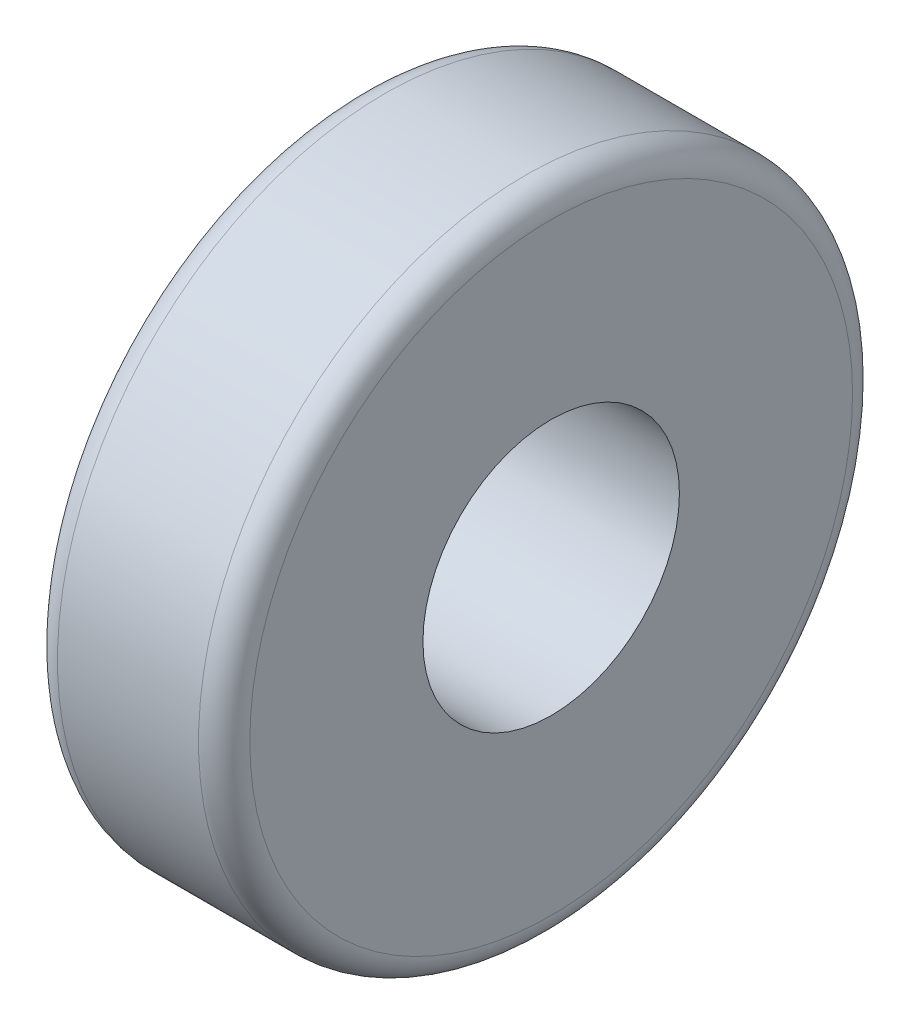
ISO-10303-21;
HEADER;
FILE_DESCRIPTION(('STEP AP214'),'2;1');
FILE_NAME('part.step','',(''),(''),'','','');
FILE_SCHEMA(('AUTOMOTIVE_DESIGN { 1 0 10303 214 1 1 1 1 }'));
ENDSEC;
DATA;
#1=APPLICATION_CONTEXT('core data for automotive mechanical design processes');
#2=APPLICATION_PROTOCOL_DEFINITION('international standard','automotive_design',2000,#1);
#3=PRODUCT_CONTEXT('',#1,'mechanical');
#4=PRODUCT('Part','Part','',(#3));
#5=PRODUCT_RELATED_PRODUCT_CATEGORY('part','',(#4));
#6=PRODUCT_DEFINITION_FORMATION('','',#4);
#7=PRODUCT_DEFINITION_CONTEXT('part definition',#1,'design');
#8=PRODUCT_DEFINITION('design','',#6,#7);
#9=PRODUCT_DEFINITION_SHAPE('','',#8);
#10=(LENGTH_UNIT() NAMED_UNIT(*) SI_UNIT(.MILLI.,.METRE.));
#11=(NAMED_UNIT(*) PLANE_ANGLE_UNIT() SI_UNIT($,.RADIAN.));
#12=(NAMED_UNIT(*) SI_UNIT($,.STERADIAN.) SOLID_ANGLE_UNIT());
#13=UNCERTAINTY_MEASURE_WITH_UNIT(LENGTH_MEASURE(1.E-05),#10,'distance_accuracy_value','');
#14=(GEOMETRIC_REPRESENTATION_CONTEXT(3) GLOBAL_UNCERTAINTY_ASSIGNED_CONTEXT((#13)) GLOBAL_UNIT_ASSIGNED_CONTEXT((#10,
#11,#12)) REPRESENTATION_CONTEXT('',''));
#15=CARTESIAN_POINT('',(0.,0.,0.));
#16=DIRECTION('',(0.,0.,1.));
#17=DIRECTION('',(1.,0.,0.));
#18=AXIS2_PLACEMENT_3D('',#15,#16,#17);
#19=CARTESIAN_POINT('',(1.5,0.,0.));
#20=DIRECTION('',(1.,0.,0.));
#21=DIRECTION('',(0.,0.,-1.));
#22=AXIS2_PLACEMENT_3D('',#19,#20,#21);
#23=PLANE('',#22);
#24=CARTESIAN_POINT('',(1.5,0.,0.));
#25=DIRECTION('',(1.,0.,0.));
#26=DIRECTION('',(0.,0.,-1.));
#27=AXIS2_PLACEMENT_3D('',#24,#25,#26);
#28=CIRCLE('',#27,2.35);
#29=CARTESIAN_POINT('',(1.5,0.,-2.35));
#30=VERTEX_POINT('',#29);
#31=EDGE_CURVE('E49',#30,#30,#28,.T.);
#32=ORIENTED_EDGE('',*,*,#31,.T.);
#33=EDGE_LOOP('',(#32));
#34=FACE_BOUND('',#33,.T.);
#35=CARTESIAN_POINT('',(1.5,0.,0.));
#36=DIRECTION('',(1.,0.,0.));
#37=DIRECTION('',(0.,0.,-1.));
#38=AXIS2_PLACEMENT_3D('',#35,#36,#37);
#39=CIRCLE('',#38,1.);
#40=CARTESIAN_POINT('',(1.5,0.,-1.));
#41=VERTEX_POINT('',#40);
#42=EDGE_CURVE('E54',#41,#41,#39,.T.);
#43=ORIENTED_EDGE('',*,*,#42,.F.);
#44=EDGE_LOOP('',(#43));
#45=FACE_BOUND('',#44,.T.);
#46=ADVANCED_FACE('F34',(#34,#45),#23,.T.);
#47=CARTESIAN_POINT('',(0.,0.,0.));
#48=DIRECTION('',(1.,0.,0.));
#49=DIRECTION('',(0.,0.,-1.));
#50=AXIS2_PLACEMENT_3D('',#47,#48,#49);
#51=PLANE('',#50);
#52=CARTESIAN_POINT('',(0.,0.,0.));
#53=DIRECTION('',(1.,0.,0.));
#54=DIRECTION('',(0.,0.,-1.));
#55=AXIS2_PLACEMENT_3D('',#52,#53,#54);
#56=CIRCLE('',#55,2.35);
#57=CARTESIAN_POINT('',(0.,0.,-2.35));
#58=VERTEX_POINT('',#57);
#59=EDGE_CURVE('E10',#58,#58,#56,.F.);
#60=ORIENTED_EDGE('',*,*,#59,.T.);
#61=EDGE_LOOP('',(#60));
#62=FACE_BOUND('',#61,.T.);
#63=CARTESIAN_POINT('',(0.,0.,0.));
#64=DIRECTION('',(1.,0.,0.));
#65=DIRECTION('',(0.,0.,-1.));
#66=AXIS2_PLACEMENT_3D('',#63,#64,#65);
#67=CIRCLE('',#66,1.);
#68=CARTESIAN_POINT('',(0.,0.,-1.));
#69=VERTEX_POINT('',#68);
#70=EDGE_CURVE('E55',#69,#69,#67,.T.);
#71=ORIENTED_EDGE('',*,*,#70,.T.);
#72=EDGE_LOOP('',(#71));
#73=FACE_BOUND('',#72,.T.);
#74=ADVANCED_FACE('F65',(#62,#73),#51,.F.);
#75=CARTESIAN_POINT('',(1.5,0.,0.));
#76=DIRECTION('',(-1.,0.,0.));
#77=DIRECTION('',(0.,0.,1.));
#78=AXIS2_PLACEMENT_3D('',#75,#76,#77);
#79=CYLINDRICAL_SURFACE('',#78,2.55);
#80=CARTESIAN_POINT('',(1.3,0.,0.));
#81=DIRECTION('',(1.,0.,0.));
#82=DIRECTION('',(0.,0.,-1.));
#83=AXIS2_PLACEMENT_3D('',#80,#81,#82);
#84=CIRCLE('',#83,2.55);
#85=CARTESIAN_POINT('',(1.3,0.,-2.55));
#86=VERTEX_POINT('',#85);
#87=EDGE_CURVE('E41',#86,#86,#84,.F.);
#88=ORIENTED_EDGE('',*,*,#87,.T.);
#89=EDGE_LOOP('',(#88));
#90=FACE_BOUND('',#89,.T.);
#91=CARTESIAN_POINT('',(0.2,0.,0.));
#92=DIRECTION('',(1.,0.,0.));
#93=DIRECTION('',(0.,0.,-1.));
#94=AXIS2_PLACEMENT_3D('',#91,#92,#93);
#95=CIRCLE('',#94,2.55);
#96=CARTESIAN_POINT('',(0.2,0.,-2.55));
#97=VERTEX_POINT('',#96);
#98=EDGE_CURVE('E45',#97,#97,#95,.T.);
#99=ORIENTED_EDGE('',*,*,#98,.T.);
#100=EDGE_LOOP('',(#99));
#101=FACE_BOUND('',#100,.T.);
#102=ADVANCED_FACE('F71',(#90,#101),#79,.T.);
#103=CARTESIAN_POINT('',(1.5,0.,0.));
#104=DIRECTION('',(-1.,0.,0.));
#105=DIRECTION('',(0.,0.,1.));
#106=AXIS2_PLACEMENT_3D('',#103,#104,#105);
#107=CYLINDRICAL_SURFACE('',#106,1.);
#108=ORIENTED_EDGE('',*,*,#42,.T.);
#109=EDGE_LOOP('',(#108));
#110=FACE_BOUND('',#109,.T.);
#111=ORIENTED_EDGE('',*,*,#70,.F.);
#112=EDGE_LOOP('',(#111));
#113=FACE_BOUND('',#112,.T.);
#114=ADVANCED_FACE('F61',(#110,#113),#107,.F.);
#115=CARTESIAN_POINT('',(1.3,0.,0.));
#116=DIRECTION('',(1.,0.,0.));
#117=DIRECTION('',(0.,0.,-1.));
#118=AXIS2_PLACEMENT_3D('',#115,#116,#117);
#119=TOROIDAL_SURFACE('',#118,2.35,0.2);
#120=ORIENTED_EDGE('',*,*,#87,.F.);
#121=EDGE_LOOP('',(#120));
#122=FACE_BOUND('',#121,.T.);
#123=ORIENTED_EDGE('',*,*,#31,.F.);
#124=EDGE_LOOP('',(#123));
#125=FACE_BOUND('',#124,.T.);
#126=ADVANCED_FACE('F76',(#122,#125),#119,.T.);
#127=CARTESIAN_POINT('',(0.2,0.,0.));
#128=DIRECTION('',(1.,0.,0.));
#129=DIRECTION('',(0.,0.,-1.));
#130=AXIS2_PLACEMENT_3D('',#127,#128,#129);
#131=TOROIDAL_SURFACE('',#130,2.35,0.2);
#132=ORIENTED_EDGE('',*,*,#59,.F.);
#133=EDGE_LOOP('',(#132));
#134=FACE_BOUND('',#133,.T.);
#135=ORIENTED_EDGE('',*,*,#98,.F.);
#136=EDGE_LOOP('',(#135));
#137=FACE_BOUND('',#136,.T.);
#138=ADVANCED_FACE('F36',(#134,#137),#131,.T.);
#139=CLOSED_SHELL('',(#46,#74,#102,#114,#126,#138));
#140=MANIFOLD_SOLID_BREP('B2',#139);
#141=ADVANCED_BREP_SHAPE_REPRESENTATION('',(#18,#140),#14);
#142=SHAPE_DEFINITION_REPRESENTATION(#9,#141);
ENDSEC;
END-ISO-10303-21;
